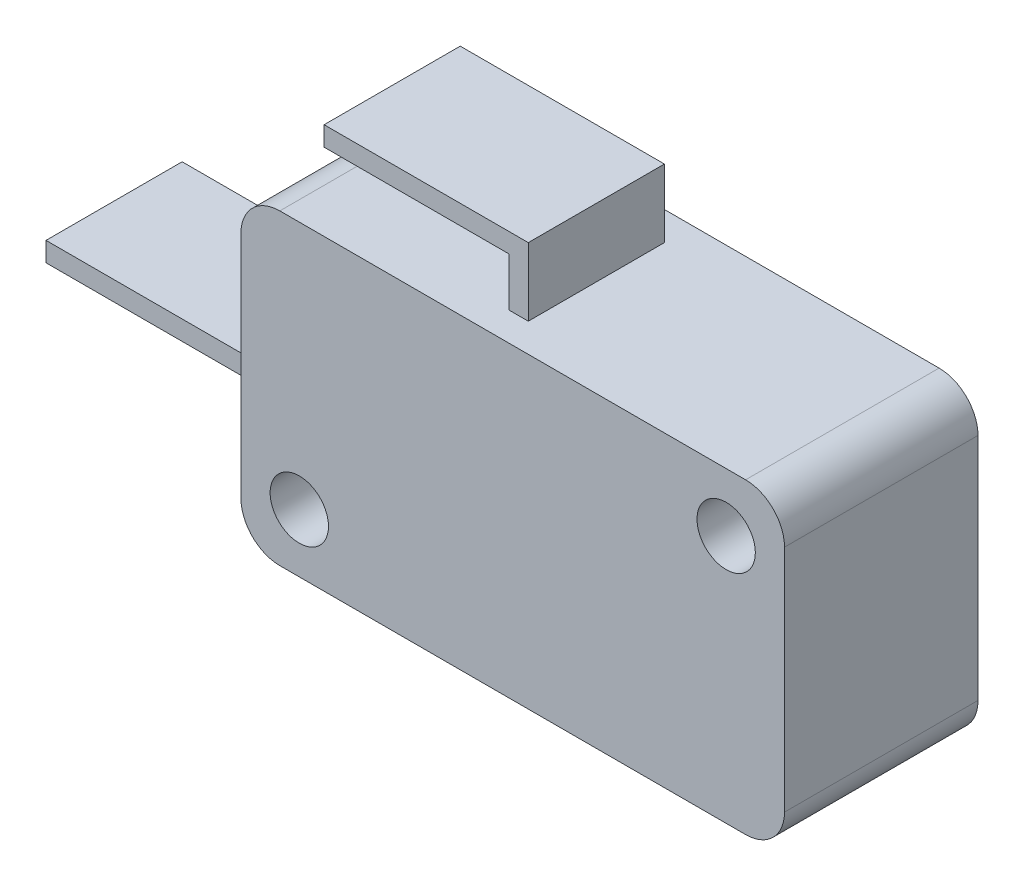
ISO-10303-21;
HEADER;
FILE_DESCRIPTION(('STEP AP214'),'2;1');
FILE_NAME('part.step','',(''),(''),'','','');
FILE_SCHEMA(('AUTOMOTIVE_DESIGN { 1 0 10303 214 1 1 1 1 }'));
ENDSEC;
DATA;
#1=APPLICATION_CONTEXT('core data for automotive mechanical design processes');
#2=APPLICATION_PROTOCOL_DEFINITION('international standard','automotive_design',2000,#1);
#3=PRODUCT_CONTEXT('',#1,'mechanical');
#4=PRODUCT('Part','Part','',(#3));
#5=PRODUCT_RELATED_PRODUCT_CATEGORY('part','',(#4));
#6=PRODUCT_DEFINITION_FORMATION('','',#4);
#7=PRODUCT_DEFINITION_CONTEXT('part definition',#1,'design');
#8=PRODUCT_DEFINITION('design','',#6,#7);
#9=PRODUCT_DEFINITION_SHAPE('','',#8);
#10=(LENGTH_UNIT() NAMED_UNIT(*) SI_UNIT(.MILLI.,.METRE.));
#11=(NAMED_UNIT(*) PLANE_ANGLE_UNIT() SI_UNIT($,.RADIAN.));
#12=(NAMED_UNIT(*) SI_UNIT($,.STERADIAN.) SOLID_ANGLE_UNIT());
#13=UNCERTAINTY_MEASURE_WITH_UNIT(LENGTH_MEASURE(1.E-05),#10,'distance_accuracy_value','');
#14=(GEOMETRIC_REPRESENTATION_CONTEXT(3) GLOBAL_UNCERTAINTY_ASSIGNED_CONTEXT((#13)) GLOBAL_UNIT_ASSIGNED_CONTEXT((#10,
#11,#12)) REPRESENTATION_CONTEXT('',''));
#15=CARTESIAN_POINT('',(0.,0.,0.));
#16=DIRECTION('',(0.,0.,1.));
#17=DIRECTION('',(1.,0.,0.));
#18=AXIS2_PLACEMENT_3D('',#15,#16,#17);
#19=CARTESIAN_POINT('',(-1.675,11.4,1.475));
#20=DIRECTION('',(1.,0.,0.));
#21=DIRECTION('',(0.,0.,-1.));
#22=AXIS2_PLACEMENT_3D('',#19,#20,#21);
#23=PLANE('',#22);
#24=DIRECTION('',(0.,0.,1.));
#25=VECTOR('',#24,1.);
#26=CARTESIAN_POINT('',(-1.675,10.4,1.475));
#27=LINE('',#26,#25);
#28=CARTESIAN_POINT('',(-1.675,10.4,1.475));
#29=VERTEX_POINT('',#28);
#30=CARTESIAN_POINT('',(-1.675,10.4,8.475));
#31=VERTEX_POINT('',#30);
#32=EDGE_CURVE('E270',#29,#31,#27,.T.);
#33=ORIENTED_EDGE('',*,*,#32,.F.);
#34=DIRECTION('',(0.,-1.,0.));
#35=VECTOR('',#34,1.);
#36=CARTESIAN_POINT('',(-1.675,11.4,1.475));
#37=LINE('',#36,#35);
#38=CARTESIAN_POINT('',(-1.675,7.9,1.475));
#39=VERTEX_POINT('',#38);
#40=EDGE_CURVE('E301',#29,#39,#37,.T.);
#41=ORIENTED_EDGE('',*,*,#40,.T.);
#42=DIRECTION('',(0.,0.,1.));
#43=VECTOR('',#42,1.);
#44=CARTESIAN_POINT('',(-1.675,7.9,1.475));
#45=LINE('',#44,#43);
#46=CARTESIAN_POINT('',(-1.675,7.9,8.475));
#47=VERTEX_POINT('',#46);
#48=EDGE_CURVE('E293',#39,#47,#45,.T.);
#49=ORIENTED_EDGE('',*,*,#48,.T.);
#50=DIRECTION('',(0.,-1.,0.));
#51=VECTOR('',#50,1.);
#52=CARTESIAN_POINT('',(-1.675,11.4,8.475));
#53=LINE('',#52,#51);
#54=EDGE_CURVE('E319',#31,#47,#53,.T.);
#55=ORIENTED_EDGE('',*,*,#54,.F.);
#56=EDGE_LOOP('',(#33,#41,#49,#55));
#57=FACE_BOUND('',#56,.T.);
#58=ADVANCED_FACE('F31',(#57),#23,.F.);
#59=CARTESIAN_POINT('',(-13.975,7.9,9.95));
#60=DIRECTION('',(0.,-1.,0.));
#61=DIRECTION('',(0.,0.,-1.));
#62=AXIS2_PLACEMENT_3D('',#59,#60,#61);
#63=PLANE('',#62);
#64=DIRECTION('',(-1.,0.,0.));
#65=VECTOR('',#64,1.);
#66=CARTESIAN_POINT('',(-13.975,7.9,0.));
#67=LINE('',#66,#65);
#68=CARTESIAN_POINT('',(11.975,7.9,0.));
#69=VERTEX_POINT('',#68);
#70=CARTESIAN_POINT('',(-11.975,7.9,0.));
#71=VERTEX_POINT('',#70);
#72=EDGE_CURVE('E371',#69,#71,#67,.T.);
#73=ORIENTED_EDGE('',*,*,#72,.T.);
#74=DIRECTION('',(0.,0.,-1.));
#75=VECTOR('',#74,1.);
#76=CARTESIAN_POINT('',(-11.975,7.9,9.95));
#77=LINE('',#76,#75);
#78=CARTESIAN_POINT('',(-11.975,7.9,9.95));
#79=VERTEX_POINT('',#78);
#80=EDGE_CURVE('E11',#71,#79,#77,.F.);
#81=ORIENTED_EDGE('',*,*,#80,.T.);
#82=DIRECTION('',(-1.,0.,0.));
#83=VECTOR('',#82,1.);
#84=CARTESIAN_POINT('',(-13.975,7.9,9.95));
#85=LINE('',#84,#83);
#86=CARTESIAN_POINT('',(11.975,7.9,9.95));
#87=VERTEX_POINT('',#86);
#88=EDGE_CURVE('E377',#87,#79,#85,.T.);
#89=ORIENTED_EDGE('',*,*,#88,.F.);
#90=DIRECTION('',(0.,0.,-1.));
#91=VECTOR('',#90,1.);
#92=CARTESIAN_POINT('',(11.975,7.9,9.95));
#93=LINE('',#92,#91);
#94=EDGE_CURVE('E39',#87,#69,#93,.T.);
#95=ORIENTED_EDGE('',*,*,#94,.T.);
#96=EDGE_LOOP('',(#73,#81,#89,#95));
#97=FACE_BOUND('',#96,.T.);
#98=ORIENTED_EDGE('',*,*,#48,.F.);
#99=DIRECTION('',(-1.,0.,0.));
#100=VECTOR('',#99,1.);
#101=CARTESIAN_POINT('',(-1.675,7.9,1.475));
#102=LINE('',#101,#100);
#103=CARTESIAN_POINT('',(-0.674999999999998,7.9,1.475));
#104=VERTEX_POINT('',#103);
#105=EDGE_CURVE('E297',#104,#39,#102,.T.);
#106=ORIENTED_EDGE('',*,*,#105,.F.);
#107=DIRECTION('',(0.,0.,-1.));
#108=VECTOR('',#107,1.);
#109=CARTESIAN_POINT('',(-0.674999999999998,7.9,1.475));
#110=LINE('',#109,#108);
#111=CARTESIAN_POINT('',(-0.674999999999997,7.9,8.475));
#112=VERTEX_POINT('',#111);
#113=EDGE_CURVE('E307',#112,#104,#110,.T.);
#114=ORIENTED_EDGE('',*,*,#113,.F.);
#115=DIRECTION('',(1.,0.,0.));
#116=VECTOR('',#115,1.);
#117=CARTESIAN_POINT('',(-1.675,7.9,8.475));
#118=LINE('',#117,#116);
#119=EDGE_CURVE('E304',#47,#112,#118,.T.);
#120=ORIENTED_EDGE('',*,*,#119,.F.);
#121=EDGE_LOOP('',(#98,#106,#114,#120));
#122=FACE_BOUND('',#121,.T.);
#123=ADVANCED_FACE('F425',(#97,#122),#63,.F.);
#124=CARTESIAN_POINT('',(-13.975,7.9,9.95));
#125=DIRECTION('',(1.,0.,0.));
#126=DIRECTION('',(0.,0.,-1.));
#127=AXIS2_PLACEMENT_3D('',#124,#125,#126);
#128=PLANE('',#127);
#129=DIRECTION('',(0.,-1.,0.));
#130=VECTOR('',#129,1.);
#131=CARTESIAN_POINT('',(-13.975,7.9,0.));
#132=LINE('',#131,#130);
#133=CARTESIAN_POINT('',(-13.975,5.9,0.));
#134=VERTEX_POINT('',#133);
#135=CARTESIAN_POINT('',(-13.975,-5.9,0.));
#136=VERTEX_POINT('',#135);
#137=EDGE_CURVE('E364',#134,#136,#132,.T.);
#138=ORIENTED_EDGE('',*,*,#137,.T.);
#139=DIRECTION('',(0.,0.,-1.));
#140=VECTOR('',#139,1.);
#141=CARTESIAN_POINT('',(-13.975,-5.9,9.95));
#142=LINE('',#141,#140);
#143=CARTESIAN_POINT('',(-13.975,-5.9,9.95));
#144=VERTEX_POINT('',#143);
#145=EDGE_CURVE('E406',#136,#144,#142,.F.);
#146=ORIENTED_EDGE('',*,*,#145,.T.);
#147=DIRECTION('',(0.,-1.,0.));
#148=VECTOR('',#147,1.);
#149=CARTESIAN_POINT('',(-13.975,7.9,9.95));
#150=LINE('',#149,#148);
#151=CARTESIAN_POINT('',(-13.975,5.9,9.95));
#152=VERTEX_POINT('',#151);
#153=EDGE_CURVE('E367',#152,#144,#150,.T.);
#154=ORIENTED_EDGE('',*,*,#153,.F.);
#155=DIRECTION('',(0.,0.,-1.));
#156=VECTOR('',#155,1.);
#157=CARTESIAN_POINT('',(-13.975,5.9,9.95));
#158=LINE('',#157,#156);
#159=EDGE_CURVE('E403',#152,#134,#158,.T.);
#160=ORIENTED_EDGE('',*,*,#159,.T.);
#161=EDGE_LOOP('',(#138,#146,#154,#160));
#162=FACE_BOUND('',#161,.T.);
#163=DIRECTION('',(0.,-1.,0.));
#164=VECTOR('',#163,1.);
#165=CARTESIAN_POINT('',(-13.975,-0.900000000000001,1.475));
#166=LINE('',#165,#164);
#167=CARTESIAN_POINT('',(-13.975,-0.900000000000001,1.475));
#168=VERTEX_POINT('',#167);
#169=CARTESIAN_POINT('',(-13.975,-1.9,1.475));
#170=VERTEX_POINT('',#169);
#171=EDGE_CURVE('E321',#168,#170,#166,.T.);
#172=ORIENTED_EDGE('',*,*,#171,.F.);
#173=DIRECTION('',(0.,0.,-1.));
#174=VECTOR('',#173,1.);
#175=CARTESIAN_POINT('',(-13.975,-0.900000000000001,1.475));
#176=LINE('',#175,#174);
#177=CARTESIAN_POINT('',(-13.975,-0.9,8.475));
#178=VERTEX_POINT('',#177);
#179=EDGE_CURVE('E326',#178,#168,#176,.T.);
#180=ORIENTED_EDGE('',*,*,#179,.F.);
#181=DIRECTION('',(0.,1.,0.));
#182=VECTOR('',#181,1.);
#183=CARTESIAN_POINT('',(-13.975,-0.9,8.475));
#184=LINE('',#183,#182);
#185=CARTESIAN_POINT('',(-13.975,-1.9,8.475));
#186=VERTEX_POINT('',#185);
#187=EDGE_CURVE('E338',#186,#178,#184,.T.);
#188=ORIENTED_EDGE('',*,*,#187,.F.);
#189=DIRECTION('',(0.,0.,1.));
#190=VECTOR('',#189,1.);
#191=CARTESIAN_POINT('',(-13.975,-1.9,1.475));
#192=LINE('',#191,#190);
#193=EDGE_CURVE('E335',#170,#186,#192,.T.);
#194=ORIENTED_EDGE('',*,*,#193,.F.);
#195=EDGE_LOOP('',(#172,#180,#188,#194));
#196=FACE_BOUND('',#195,.T.);
#197=ADVANCED_FACE('F441',(#162,#196),#128,.F.);
#198=CARTESIAN_POINT('',(-13.975,-7.9,9.95));
#199=DIRECTION('',(0.,1.,0.));
#200=DIRECTION('',(0.,0.,1.));
#201=AXIS2_PLACEMENT_3D('',#198,#199,#200);
#202=PLANE('',#201);
#203=DIRECTION('',(-1.,0.,0.));
#204=VECTOR('',#203,1.);
#205=CARTESIAN_POINT('',(-1.525,-7.9,7.33225893094414));
#206=LINE('',#205,#204);
#207=CARTESIAN_POINT('',(-1.525,-7.9,7.33225893094414));
#208=VERTEX_POINT('',#207);
#209=CARTESIAN_POINT('',(-2.525,-7.9,7.33225893094414));
#210=VERTEX_POINT('',#209);
#211=EDGE_CURVE('E235',#208,#210,#206,.T.);
#212=ORIENTED_EDGE('',*,*,#211,.F.);
#213=DIRECTION('',(0.,0.,1.));
#214=VECTOR('',#213,1.);
#215=CARTESIAN_POINT('',(-1.525,-7.9,7.33225893094414));
#216=LINE('',#215,#214);
#217=CARTESIAN_POINT('',(-1.525,-7.9,3.49599846688875));
#218=VERTEX_POINT('',#217);
#219=EDGE_CURVE('E46',#218,#208,#216,.T.);
#220=ORIENTED_EDGE('',*,*,#219,.F.);
#221=DIRECTION('',(1.,0.,0.));
#222=VECTOR('',#221,1.);
#223=CARTESIAN_POINT('',(-1.525,-7.9,3.49599846688875));
#224=LINE('',#223,#222);
#225=CARTESIAN_POINT('',(-2.525,-7.9,3.49599846688875));
#226=VERTEX_POINT('',#225);
#227=EDGE_CURVE('E223',#226,#218,#224,.T.);
#228=ORIENTED_EDGE('',*,*,#227,.F.);
#229=DIRECTION('',(0.,0.,-1.));
#230=VECTOR('',#229,1.);
#231=CARTESIAN_POINT('',(-2.525,-7.9,7.33225893094414));
#232=LINE('',#231,#230);
#233=EDGE_CURVE('E226',#210,#226,#232,.T.);
#234=ORIENTED_EDGE('',*,*,#233,.F.);
#235=EDGE_LOOP('',(#212,#220,#228,#234));
#236=FACE_BOUND('',#235,.T.);
#237=DIRECTION('',(-1.,0.,0.));
#238=VECTOR('',#237,1.);
#239=CARTESIAN_POINT('',(9.575,-7.9,6.975));
#240=LINE('',#239,#238);
#241=CARTESIAN_POINT('',(9.575,-7.9,6.975));
#242=VERTEX_POINT('',#241);
#243=CARTESIAN_POINT('',(6.975,-7.9,6.975));
#244=VERTEX_POINT('',#243);
#245=EDGE_CURVE('E260',#242,#244,#240,.T.);
#246=ORIENTED_EDGE('',*,*,#245,.F.);
#247=DIRECTION('',(0.,0.,1.));
#248=VECTOR('',#247,1.);
#249=CARTESIAN_POINT('',(9.575,-7.9,6.975));
#250=LINE('',#249,#248);
#251=CARTESIAN_POINT('',(9.575,-7.9,2.975));
#252=VERTEX_POINT('',#251);
#253=EDGE_CURVE('E54',#252,#242,#250,.T.);
#254=ORIENTED_EDGE('',*,*,#253,.F.);
#255=DIRECTION('',(1.,0.,0.));
#256=VECTOR('',#255,1.);
#257=CARTESIAN_POINT('',(9.575,-7.9,2.975));
#258=LINE('',#257,#256);
#259=CARTESIAN_POINT('',(6.975,-7.9,2.975));
#260=VERTEX_POINT('',#259);
#261=EDGE_CURVE('E249',#260,#252,#258,.T.);
#262=ORIENTED_EDGE('',*,*,#261,.F.);
#263=DIRECTION('',(0.,0.,-1.));
#264=VECTOR('',#263,1.);
#265=CARTESIAN_POINT('',(6.975,-7.9,6.975));
#266=LINE('',#265,#264);
#267=EDGE_CURVE('E263',#244,#260,#266,.T.);
#268=ORIENTED_EDGE('',*,*,#267,.F.);
#269=EDGE_LOOP('',(#246,#254,#262,#268));
#270=FACE_BOUND('',#269,.T.);
#271=DIRECTION('',(1.,0.,0.));
#272=VECTOR('',#271,1.);
#273=CARTESIAN_POINT('',(-13.975,-7.9,9.95));
#274=LINE('',#273,#272);
#275=CARTESIAN_POINT('',(-11.975,-7.9,9.95));
#276=VERTEX_POINT('',#275);
#277=CARTESIAN_POINT('',(11.975,-7.9,9.95));
#278=VERTEX_POINT('',#277);
#279=EDGE_CURVE('E370',#276,#278,#274,.T.);
#280=ORIENTED_EDGE('',*,*,#279,.F.);
#281=DIRECTION('',(0.,0.,-1.));
#282=VECTOR('',#281,1.);
#283=CARTESIAN_POINT('',(-11.975,-7.9,9.95));
#284=LINE('',#283,#282);
#285=CARTESIAN_POINT('',(-11.975,-7.9,0.));
#286=VERTEX_POINT('',#285);
#287=EDGE_CURVE('E392',#276,#286,#284,.T.);
#288=ORIENTED_EDGE('',*,*,#287,.T.);
#289=DIRECTION('',(1.,0.,0.));
#290=VECTOR('',#289,1.);
#291=CARTESIAN_POINT('',(-13.975,-7.9,0.));
#292=LINE('',#291,#290);
#293=CARTESIAN_POINT('',(11.975,-7.9,0.));
#294=VERTEX_POINT('',#293);
#295=EDGE_CURVE('E383',#286,#294,#292,.T.);
#296=ORIENTED_EDGE('',*,*,#295,.T.);
#297=DIRECTION('',(0.,0.,-1.));
#298=VECTOR('',#297,1.);
#299=CARTESIAN_POINT('',(11.975,-7.9,9.95));
#300=LINE('',#299,#298);
#301=EDGE_CURVE('E380',#294,#278,#300,.F.);
#302=ORIENTED_EDGE('',*,*,#301,.T.);
#303=EDGE_LOOP('',(#280,#288,#296,#302));
#304=FACE_BOUND('',#303,.T.);
#305=ADVANCED_FACE('F452',(#236,#270,#304),#202,.F.);
#306=CARTESIAN_POINT('',(13.975,7.9,9.95));
#307=DIRECTION('',(-1.,0.,0.));
#308=DIRECTION('',(0.,-1.,0.));
#309=AXIS2_PLACEMENT_3D('',#306,#307,#308);
#310=PLANE('',#309);
#311=DIRECTION('',(0.,1.,0.));
#312=VECTOR('',#311,1.);
#313=CARTESIAN_POINT('',(13.975,7.9,9.95));
#314=LINE('',#313,#312);
#315=CARTESIAN_POINT('',(13.975,-5.9,9.95));
#316=VERTEX_POINT('',#315);
#317=CARTESIAN_POINT('',(13.975,5.9,9.95));
#318=VERTEX_POINT('',#317);
#319=EDGE_CURVE('E374',#316,#318,#314,.T.);
#320=ORIENTED_EDGE('',*,*,#319,.F.);
#321=DIRECTION('',(0.,0.,-1.));
#322=VECTOR('',#321,1.);
#323=CARTESIAN_POINT('',(13.975,-5.9,9.95));
#324=LINE('',#323,#322);
#325=CARTESIAN_POINT('',(13.975,-5.9,0.));
#326=VERTEX_POINT('',#325);
#327=EDGE_CURVE('E418',#316,#326,#324,.T.);
#328=ORIENTED_EDGE('',*,*,#327,.T.);
#329=DIRECTION('',(0.,1.,0.));
#330=VECTOR('',#329,1.);
#331=CARTESIAN_POINT('',(13.975,7.9,0.));
#332=LINE('',#331,#330);
#333=CARTESIAN_POINT('',(13.975,5.9,0.));
#334=VERTEX_POINT('',#333);
#335=EDGE_CURVE('E386',#326,#334,#332,.T.);
#336=ORIENTED_EDGE('',*,*,#335,.T.);
#337=DIRECTION('',(0.,0.,-1.));
#338=VECTOR('',#337,1.);
#339=CARTESIAN_POINT('',(13.975,5.9,9.95));
#340=LINE('',#339,#338);
#341=EDGE_CURVE('E416',#334,#318,#340,.F.);
#342=ORIENTED_EDGE('',*,*,#341,.T.);
#343=EDGE_LOOP('',(#320,#328,#336,#342));
#344=FACE_BOUND('',#343,.T.);
#345=ADVANCED_FACE('F460',(#344),#310,.F.);
#346=CARTESIAN_POINT('',(-13.975,-7.9,9.95));
#347=DIRECTION('',(0.,0.,1.));
#348=DIRECTION('',(1.,0.,0.));
#349=AXIS2_PLACEMENT_3D('',#346,#347,#348);
#350=PLANE('',#349);
#351=CARTESIAN_POINT('',(-10.975,-4.9,9.95));
#352=DIRECTION('',(0.,0.,1.));
#353=DIRECTION('',(1.,0.,0.));
#354=AXIS2_PLACEMENT_3D('',#351,#352,#353);
#355=CIRCLE('',#354,1.5);
#356=CARTESIAN_POINT('',(-9.475,-4.9,9.95));
#357=VERTEX_POINT('',#356);
#358=EDGE_CURVE('E354',#357,#357,#355,.T.);
#359=ORIENTED_EDGE('',*,*,#358,.F.);
#360=EDGE_LOOP('',(#359));
#361=FACE_BOUND('',#360,.T.);
#362=CARTESIAN_POINT('',(10.975,4.9,9.95));
#363=DIRECTION('',(0.,0.,1.));
#364=DIRECTION('',(1.,0.,0.));
#365=AXIS2_PLACEMENT_3D('',#362,#363,#364);
#366=CIRCLE('',#365,1.5);
#367=CARTESIAN_POINT('',(12.475,4.9,9.95));
#368=VERTEX_POINT('',#367);
#369=EDGE_CURVE('E358',#368,#368,#366,.T.);
#370=ORIENTED_EDGE('',*,*,#369,.F.);
#371=EDGE_LOOP('',(#370));
#372=FACE_BOUND('',#371,.T.);
#373=ORIENTED_EDGE('',*,*,#153,.T.);
#374=CARTESIAN_POINT('',(-11.975,-5.9,9.95));
#375=DIRECTION('',(0.,0.,1.));
#376=DIRECTION('',(1.,0.,0.));
#377=AXIS2_PLACEMENT_3D('',#374,#375,#376);
#378=CIRCLE('',#377,2.);
#379=EDGE_CURVE('E414',#144,#276,#378,.T.);
#380=ORIENTED_EDGE('',*,*,#379,.T.);
#381=ORIENTED_EDGE('',*,*,#279,.T.);
#382=CARTESIAN_POINT('',(11.975,-5.9,9.95));
#383=DIRECTION('',(0.,0.,1.));
#384=DIRECTION('',(1.,0.,0.));
#385=AXIS2_PLACEMENT_3D('',#382,#383,#384);
#386=CIRCLE('',#385,2.);
#387=EDGE_CURVE('E412',#278,#316,#386,.T.);
#388=ORIENTED_EDGE('',*,*,#387,.T.);
#389=ORIENTED_EDGE('',*,*,#319,.T.);
#390=CARTESIAN_POINT('',(11.975,5.9,9.95));
#391=DIRECTION('',(0.,0.,1.));
#392=DIRECTION('',(1.,0.,0.));
#393=AXIS2_PLACEMENT_3D('',#390,#391,#392);
#394=CIRCLE('',#393,2.);
#395=EDGE_CURVE('E408',#318,#87,#394,.T.);
#396=ORIENTED_EDGE('',*,*,#395,.T.);
#397=ORIENTED_EDGE('',*,*,#88,.T.);
#398=CARTESIAN_POINT('',(-11.975,5.9,9.95));
#399=DIRECTION('',(0.,0.,1.));
#400=DIRECTION('',(1.,0.,0.));
#401=AXIS2_PLACEMENT_3D('',#398,#399,#400);
#402=CIRCLE('',#401,2.);
#403=EDGE_CURVE('E410',#79,#152,#402,.T.);
#404=ORIENTED_EDGE('',*,*,#403,.T.);
#405=EDGE_LOOP('',(#373,#380,#381,#388,#389,#396,#397,#404));
#406=FACE_BOUND('',#405,.T.);
#407=ADVANCED_FACE('F446',(#361,#372,#406),#350,.T.);
#408=CARTESIAN_POINT('',(-13.975,-7.9,0.));
#409=DIRECTION('',(0.,0.,1.));
#410=DIRECTION('',(1.,0.,0.));
#411=AXIS2_PLACEMENT_3D('',#408,#409,#410);
#412=PLANE('',#411);
#413=CARTESIAN_POINT('',(-10.975,-4.9,0.));
#414=DIRECTION('',(0.,0.,1.));
#415=DIRECTION('',(1.,0.,0.));
#416=AXIS2_PLACEMENT_3D('',#413,#414,#415);
#417=CIRCLE('',#416,1.5);
#418=CARTESIAN_POINT('',(-9.475,-4.9,0.));
#419=VERTEX_POINT('',#418);
#420=EDGE_CURVE('E355',#419,#419,#417,.T.);
#421=ORIENTED_EDGE('',*,*,#420,.T.);
#422=EDGE_LOOP('',(#421));
#423=FACE_BOUND('',#422,.T.);
#424=CARTESIAN_POINT('',(10.975,4.9,0.));
#425=DIRECTION('',(0.,0.,1.));
#426=DIRECTION('',(1.,0.,0.));
#427=AXIS2_PLACEMENT_3D('',#424,#425,#426);
#428=CIRCLE('',#427,1.5);
#429=CARTESIAN_POINT('',(12.475,4.9,0.));
#430=VERTEX_POINT('',#429);
#431=EDGE_CURVE('E361',#430,#430,#428,.T.);
#432=ORIENTED_EDGE('',*,*,#431,.T.);
#433=EDGE_LOOP('',(#432));
#434=FACE_BOUND('',#433,.T.);
#435=ORIENTED_EDGE('',*,*,#295,.F.);
#436=CARTESIAN_POINT('',(-11.975,-5.9,0.));
#437=DIRECTION('',(0.,0.,1.));
#438=DIRECTION('',(1.,0.,0.));
#439=AXIS2_PLACEMENT_3D('',#436,#437,#438);
#440=CIRCLE('',#439,2.);
#441=EDGE_CURVE('E401',#286,#136,#440,.F.);
#442=ORIENTED_EDGE('',*,*,#441,.T.);
#443=ORIENTED_EDGE('',*,*,#137,.F.);
#444=CARTESIAN_POINT('',(-11.975,5.9,0.));
#445=DIRECTION('',(0.,0.,1.));
#446=DIRECTION('',(1.,0.,0.));
#447=AXIS2_PLACEMENT_3D('',#444,#445,#446);
#448=CIRCLE('',#447,2.);
#449=EDGE_CURVE('E397',#134,#71,#448,.F.);
#450=ORIENTED_EDGE('',*,*,#449,.T.);
#451=ORIENTED_EDGE('',*,*,#72,.F.);
#452=CARTESIAN_POINT('',(11.975,5.9,0.));
#453=DIRECTION('',(0.,0.,1.));
#454=DIRECTION('',(1.,0.,0.));
#455=AXIS2_PLACEMENT_3D('',#452,#453,#454);
#456=CIRCLE('',#455,2.);
#457=EDGE_CURVE('E395',#69,#334,#456,.F.);
#458=ORIENTED_EDGE('',*,*,#457,.T.);
#459=ORIENTED_EDGE('',*,*,#335,.F.);
#460=CARTESIAN_POINT('',(11.975,-5.9,0.));
#461=DIRECTION('',(0.,0.,1.));
#462=DIRECTION('',(1.,0.,0.));
#463=AXIS2_PLACEMENT_3D('',#460,#461,#462);
#464=CIRCLE('',#463,2.);
#465=EDGE_CURVE('E399',#326,#294,#464,.F.);
#466=ORIENTED_EDGE('',*,*,#465,.T.);
#467=EDGE_LOOP('',(#435,#442,#443,#450,#451,#458,#459,#466));
#468=FACE_BOUND('',#467,.T.);
#469=ADVANCED_FACE('F432',(#423,#434,#468),#412,.F.);
#470=CARTESIAN_POINT('',(10.975,4.9,0.));
#471=DIRECTION('',(0.,0.,1.));
#472=DIRECTION('',(1.,0.,0.));
#473=AXIS2_PLACEMENT_3D('',#470,#471,#472);
#474=CYLINDRICAL_SURFACE('',#473,1.5);
#475=ORIENTED_EDGE('',*,*,#431,.F.);
#476=EDGE_LOOP('',(#475));
#477=FACE_BOUND('',#476,.T.);
#478=ORIENTED_EDGE('',*,*,#369,.T.);
#479=EDGE_LOOP('',(#478));
#480=FACE_BOUND('',#479,.T.);
#481=ADVANCED_FACE('F501',(#477,#480),#474,.F.);
#482=CARTESIAN_POINT('',(-10.975,-4.9,0.));
#483=DIRECTION('',(0.,0.,1.));
#484=DIRECTION('',(1.,0.,0.));
#485=AXIS2_PLACEMENT_3D('',#482,#483,#484);
#486=CYLINDRICAL_SURFACE('',#485,1.5);
#487=ORIENTED_EDGE('',*,*,#420,.F.);
#488=EDGE_LOOP('',(#487));
#489=FACE_BOUND('',#488,.T.);
#490=ORIENTED_EDGE('',*,*,#358,.T.);
#491=EDGE_LOOP('',(#490));
#492=FACE_BOUND('',#491,.T.);
#493=ADVANCED_FACE('F498',(#489,#492),#486,.F.);
#494=CARTESIAN_POINT('',(-11.975,-5.9,9.95));
#495=DIRECTION('',(0.,0.,-1.));
#496=DIRECTION('',(-1.,0.,0.));
#497=AXIS2_PLACEMENT_3D('',#494,#495,#496);
#498=CYLINDRICAL_SURFACE('',#497,2.);
#499=ORIENTED_EDGE('',*,*,#379,.F.);
#500=ORIENTED_EDGE('',*,*,#145,.F.);
#501=ORIENTED_EDGE('',*,*,#441,.F.);
#502=ORIENTED_EDGE('',*,*,#287,.F.);
#503=EDGE_LOOP('',(#499,#500,#501,#502));
#504=FACE_BOUND('',#503,.T.);
#505=ADVANCED_FACE('F450',(#504),#498,.T.);
#506=CARTESIAN_POINT('',(11.975,-5.9,9.95));
#507=DIRECTION('',(0.,0.,-1.));
#508=DIRECTION('',(-1.,0.,0.));
#509=AXIS2_PLACEMENT_3D('',#506,#507,#508);
#510=CYLINDRICAL_SURFACE('',#509,2.);
#511=ORIENTED_EDGE('',*,*,#387,.F.);
#512=ORIENTED_EDGE('',*,*,#301,.F.);
#513=ORIENTED_EDGE('',*,*,#465,.F.);
#514=ORIENTED_EDGE('',*,*,#327,.F.);
#515=EDGE_LOOP('',(#511,#512,#513,#514));
#516=FACE_BOUND('',#515,.T.);
#517=ADVANCED_FACE('F457',(#516),#510,.T.);
#518=CARTESIAN_POINT('',(-11.975,5.9,9.95));
#519=DIRECTION('',(0.,0.,-1.));
#520=DIRECTION('',(-1.,0.,0.));
#521=AXIS2_PLACEMENT_3D('',#518,#519,#520);
#522=CYLINDRICAL_SURFACE('',#521,2.);
#523=ORIENTED_EDGE('',*,*,#403,.F.);
#524=ORIENTED_EDGE('',*,*,#80,.F.);
#525=ORIENTED_EDGE('',*,*,#449,.F.);
#526=ORIENTED_EDGE('',*,*,#159,.F.);
#527=EDGE_LOOP('',(#523,#524,#525,#526));
#528=FACE_BOUND('',#527,.T.);
#529=ADVANCED_FACE('F438',(#528),#522,.T.);
#530=CARTESIAN_POINT('',(11.975,5.9,9.95));
#531=DIRECTION('',(0.,0.,-1.));
#532=DIRECTION('',(-1.,0.,0.));
#533=AXIS2_PLACEMENT_3D('',#530,#531,#532);
#534=CYLINDRICAL_SURFACE('',#533,2.);
#535=ORIENTED_EDGE('',*,*,#395,.F.);
#536=ORIENTED_EDGE('',*,*,#341,.F.);
#537=ORIENTED_EDGE('',*,*,#457,.F.);
#538=ORIENTED_EDGE('',*,*,#94,.F.);
#539=EDGE_LOOP('',(#535,#536,#537,#538));
#540=FACE_BOUND('',#539,.T.);
#541=ADVANCED_FACE('F33',(#540),#534,.T.);
#542=CARTESIAN_POINT('',(-25.475,-0.900000000000001,1.475));
#543=DIRECTION('',(0.,0.,1.));
#544=DIRECTION('',(1.,0.,0.));
#545=AXIS2_PLACEMENT_3D('',#542,#543,#544);
#546=PLANE('',#545);
#547=ORIENTED_EDGE('',*,*,#171,.T.);
#548=DIRECTION('',(1.,0.,0.));
#549=VECTOR('',#548,1.);
#550=CARTESIAN_POINT('',(-25.475,-1.9,1.475));
#551=LINE('',#550,#549);
#552=CARTESIAN_POINT('',(-25.475,-1.9,1.475));
#553=VERTEX_POINT('',#552);
#554=EDGE_CURVE('E351',#553,#170,#551,.T.);
#555=ORIENTED_EDGE('',*,*,#554,.F.);
#556=DIRECTION('',(0.,-1.,0.));
#557=VECTOR('',#556,1.);
#558=CARTESIAN_POINT('',(-25.475,-0.900000000000001,1.475));
#559=LINE('',#558,#557);
#560=CARTESIAN_POINT('',(-25.475,-0.900000000000001,1.475));
#561=VERTEX_POINT('',#560);
#562=EDGE_CURVE('E322',#561,#553,#559,.T.);
#563=ORIENTED_EDGE('',*,*,#562,.F.);
#564=DIRECTION('',(1.,0.,0.));
#565=VECTOR('',#564,1.);
#566=CARTESIAN_POINT('',(-25.475,-0.900000000000001,1.475));
#567=LINE('',#566,#565);
#568=EDGE_CURVE('E332',#561,#168,#567,.T.);
#569=ORIENTED_EDGE('',*,*,#568,.T.);
#570=EDGE_LOOP('',(#547,#555,#563,#569));
#571=FACE_BOUND('',#570,.T.);
#572=ADVANCED_FACE('F463',(#571),#546,.F.);
#573=CARTESIAN_POINT('',(-25.475,-1.9,1.475));
#574=DIRECTION('',(0.,1.,0.));
#575=DIRECTION('',(0.,0.,1.));
#576=AXIS2_PLACEMENT_3D('',#573,#574,#575);
#577=PLANE('',#576);
#578=ORIENTED_EDGE('',*,*,#193,.T.);
#579=DIRECTION('',(1.,0.,0.));
#580=VECTOR('',#579,1.);
#581=CARTESIAN_POINT('',(-25.475,-1.9,8.475));
#582=LINE('',#581,#580);
#583=CARTESIAN_POINT('',(-25.475,-1.9,8.475));
#584=VERTEX_POINT('',#583);
#585=EDGE_CURVE('E348',#584,#186,#582,.T.);
#586=ORIENTED_EDGE('',*,*,#585,.F.);
#587=DIRECTION('',(0.,0.,1.));
#588=VECTOR('',#587,1.);
#589=CARTESIAN_POINT('',(-25.475,-1.9,1.475));
#590=LINE('',#589,#588);
#591=EDGE_CURVE('E325',#553,#584,#590,.T.);
#592=ORIENTED_EDGE('',*,*,#591,.F.);
#593=ORIENTED_EDGE('',*,*,#554,.T.);
#594=EDGE_LOOP('',(#578,#586,#592,#593));
#595=FACE_BOUND('',#594,.T.);
#596=ADVANCED_FACE('F468',(#595),#577,.F.);
#597=CARTESIAN_POINT('',(-25.475,-0.9,8.475));
#598=DIRECTION('',(0.,0.,-1.));
#599=DIRECTION('',(-1.,0.,0.));
#600=AXIS2_PLACEMENT_3D('',#597,#598,#599);
#601=PLANE('',#600);
#602=ORIENTED_EDGE('',*,*,#187,.T.);
#603=DIRECTION('',(1.,0.,0.));
#604=VECTOR('',#603,1.);
#605=CARTESIAN_POINT('',(-25.475,-0.9,8.475));
#606=LINE('',#605,#604);
#607=CARTESIAN_POINT('',(-25.475,-0.9,8.475));
#608=VERTEX_POINT('',#607);
#609=EDGE_CURVE('E345',#608,#178,#606,.T.);
#610=ORIENTED_EDGE('',*,*,#609,.F.);
#611=DIRECTION('',(0.,1.,0.));
#612=VECTOR('',#611,1.);
#613=CARTESIAN_POINT('',(-25.475,-0.9,8.475));
#614=LINE('',#613,#612);
#615=EDGE_CURVE('E328',#584,#608,#614,.T.);
#616=ORIENTED_EDGE('',*,*,#615,.F.);
#617=ORIENTED_EDGE('',*,*,#585,.T.);
#618=EDGE_LOOP('',(#602,#610,#616,#617));
#619=FACE_BOUND('',#618,.T.);
#620=ADVANCED_FACE('F490',(#619),#601,.F.);
#621=CARTESIAN_POINT('',(-25.475,-0.900000000000001,1.475));
#622=DIRECTION('',(0.,-1.,0.));
#623=DIRECTION('',(0.,0.,-1.));
#624=AXIS2_PLACEMENT_3D('',#621,#622,#623);
#625=PLANE('',#624);
#626=ORIENTED_EDGE('',*,*,#179,.T.);
#627=ORIENTED_EDGE('',*,*,#568,.F.);
#628=DIRECTION('',(0.,0.,-1.));
#629=VECTOR('',#628,1.);
#630=CARTESIAN_POINT('',(-25.475,-0.900000000000001,1.475));
#631=LINE('',#630,#629);
#632=EDGE_CURVE('E330',#608,#561,#631,.T.);
#633=ORIENTED_EDGE('',*,*,#632,.F.);
#634=ORIENTED_EDGE('',*,*,#609,.T.);
#635=EDGE_LOOP('',(#626,#627,#633,#634));
#636=FACE_BOUND('',#635,.T.);
#637=ADVANCED_FACE('F486',(#636),#625,.F.);
#638=CARTESIAN_POINT('',(-25.475,-1.9,1.475));
#639=DIRECTION('',(-1.,0.,0.));
#640=DIRECTION('',(0.,0.,1.));
#641=AXIS2_PLACEMENT_3D('',#638,#639,#640);
#642=PLANE('',#641);
#643=ORIENTED_EDGE('',*,*,#562,.T.);
#644=ORIENTED_EDGE('',*,*,#591,.T.);
#645=ORIENTED_EDGE('',*,*,#615,.T.);
#646=ORIENTED_EDGE('',*,*,#632,.T.);
#647=EDGE_LOOP('',(#643,#644,#645,#646));
#648=FACE_BOUND('',#647,.T.);
#649=ADVANCED_FACE('F483',(#648),#642,.T.);
#650=CARTESIAN_POINT('',(-1.675,11.4,8.475));
#651=DIRECTION('',(0.,0.,-1.));
#652=DIRECTION('',(-1.,0.,0.));
#653=AXIS2_PLACEMENT_3D('',#650,#651,#652);
#654=PLANE('',#653);
#655=ORIENTED_EDGE('',*,*,#119,.T.);
#656=DIRECTION('',(0.,-1.,0.));
#657=VECTOR('',#656,1.);
#658=CARTESIAN_POINT('',(-0.674999999999998,11.4,8.475));
#659=LINE('',#658,#657);
#660=CARTESIAN_POINT('',(-0.674999999999998,11.4,8.475));
#661=VERTEX_POINT('',#660);
#662=EDGE_CURVE('E316',#661,#112,#659,.T.);
#663=ORIENTED_EDGE('',*,*,#662,.F.);
#664=DIRECTION('',(1.,0.,0.));
#665=VECTOR('',#664,1.);
#666=CARTESIAN_POINT('',(-1.675,11.4,8.475));
#667=LINE('',#666,#665);
#668=CARTESIAN_POINT('',(-11.175,11.4,8.475));
#669=VERTEX_POINT('',#668);
#670=EDGE_CURVE('E294',#669,#661,#667,.T.);
#671=ORIENTED_EDGE('',*,*,#670,.F.);
#672=DIRECTION('',(0.,1.,0.));
#673=VECTOR('',#672,1.);
#674=CARTESIAN_POINT('',(-11.175,11.4,8.475));
#675=LINE('',#674,#673);
#676=CARTESIAN_POINT('',(-11.175,10.4,8.475));
#677=VERTEX_POINT('',#676);
#678=EDGE_CURVE('E281',#677,#669,#675,.T.);
#679=ORIENTED_EDGE('',*,*,#678,.F.);
#680=DIRECTION('',(1.,0.,0.));
#681=VECTOR('',#680,1.);
#682=CARTESIAN_POINT('',(-11.175,10.4,8.475));
#683=LINE('',#682,#681);
#684=EDGE_CURVE('E287',#677,#31,#683,.T.);
#685=ORIENTED_EDGE('',*,*,#684,.T.);
#686=ORIENTED_EDGE('',*,*,#54,.T.);
#687=EDGE_LOOP('',(#655,#663,#671,#679,#685,#686));
#688=FACE_BOUND('',#687,.T.);
#689=ADVANCED_FACE('F481',(#688),#654,.F.);
#690=CARTESIAN_POINT('',(-0.674999999999998,11.4,1.475));
#691=DIRECTION('',(-1.,0.,0.));
#692=DIRECTION('',(0.,0.,1.));
#693=AXIS2_PLACEMENT_3D('',#690,#691,#692);
#694=PLANE('',#693);
#695=ORIENTED_EDGE('',*,*,#113,.T.);
#696=DIRECTION('',(0.,-1.,0.));
#697=VECTOR('',#696,1.);
#698=CARTESIAN_POINT('',(-0.674999999999998,11.4,1.475));
#699=LINE('',#698,#697);
#700=CARTESIAN_POINT('',(-0.674999999999998,11.4,1.475));
#701=VERTEX_POINT('',#700);
#702=EDGE_CURVE('E313',#701,#104,#699,.T.);
#703=ORIENTED_EDGE('',*,*,#702,.F.);
#704=DIRECTION('',(0.,0.,-1.));
#705=VECTOR('',#704,1.);
#706=CARTESIAN_POINT('',(-0.674999999999998,11.4,1.475));
#707=LINE('',#706,#705);
#708=EDGE_CURVE('E296',#661,#701,#707,.T.);
#709=ORIENTED_EDGE('',*,*,#708,.F.);
#710=ORIENTED_EDGE('',*,*,#662,.T.);
#711=EDGE_LOOP('',(#695,#703,#709,#710));
#712=FACE_BOUND('',#711,.T.);
#713=ADVANCED_FACE('F583',(#712),#694,.F.);
#714=CARTESIAN_POINT('',(-1.675,11.4,1.475));
#715=DIRECTION('',(0.,0.,1.));
#716=DIRECTION('',(1.,0.,0.));
#717=AXIS2_PLACEMENT_3D('',#714,#715,#716);
#718=PLANE('',#717);
#719=ORIENTED_EDGE('',*,*,#105,.T.);
#720=ORIENTED_EDGE('',*,*,#40,.F.);
#721=DIRECTION('',(1.,0.,0.));
#722=VECTOR('',#721,1.);
#723=CARTESIAN_POINT('',(-11.175,10.4,1.475));
#724=LINE('',#723,#722);
#725=CARTESIAN_POINT('',(-11.175,10.4,1.475));
#726=VERTEX_POINT('',#725);
#727=EDGE_CURVE('E291',#726,#29,#724,.T.);
#728=ORIENTED_EDGE('',*,*,#727,.F.);
#729=DIRECTION('',(0.,-1.,0.));
#730=VECTOR('',#729,1.);
#731=CARTESIAN_POINT('',(-11.175,11.4,1.475));
#732=LINE('',#731,#730);
#733=CARTESIAN_POINT('',(-11.175,11.4,1.475));
#734=VERTEX_POINT('',#733);
#735=EDGE_CURVE('E276',#734,#726,#732,.T.);
#736=ORIENTED_EDGE('',*,*,#735,.F.);
#737=DIRECTION('',(-1.,0.,0.));
#738=VECTOR('',#737,1.);
#739=CARTESIAN_POINT('',(-1.675,11.4,1.475));
#740=LINE('',#739,#738);
#741=EDGE_CURVE('E299',#701,#734,#740,.T.);
#742=ORIENTED_EDGE('',*,*,#741,.F.);
#743=ORIENTED_EDGE('',*,*,#702,.T.);
#744=EDGE_LOOP('',(#719,#720,#728,#736,#742,#743));
#745=FACE_BOUND('',#744,.T.);
#746=ADVANCED_FACE('F587',(#745),#718,.F.);
#747=CARTESIAN_POINT('',(-1.675,11.4,8.475));
#748=DIRECTION('',(0.,1.,0.));
#749=DIRECTION('',(0.,0.,1.));
#750=AXIS2_PLACEMENT_3D('',#747,#748,#749);
#751=PLANE('',#750);
#752=ORIENTED_EDGE('',*,*,#741,.T.);
#753=DIRECTION('',(0.,0.,-1.));
#754=VECTOR('',#753,1.);
#755=CARTESIAN_POINT('',(-11.175,11.4,1.475));
#756=LINE('',#755,#754);
#757=EDGE_CURVE('E284',#669,#734,#756,.T.);
#758=ORIENTED_EDGE('',*,*,#757,.F.);
#759=ORIENTED_EDGE('',*,*,#670,.T.);
#760=ORIENTED_EDGE('',*,*,#708,.T.);
#761=EDGE_LOOP('',(#752,#758,#759,#760));
#762=FACE_BOUND('',#761,.T.);
#763=ADVANCED_FACE('F610',(#762),#751,.T.);
#764=CARTESIAN_POINT('',(-11.175,10.4,1.475));
#765=DIRECTION('',(0.,1.,0.));
#766=DIRECTION('',(0.,0.,1.));
#767=AXIS2_PLACEMENT_3D('',#764,#765,#766);
#768=PLANE('',#767);
#769=ORIENTED_EDGE('',*,*,#32,.T.);
#770=ORIENTED_EDGE('',*,*,#684,.F.);
#771=DIRECTION('',(0.,0.,1.));
#772=VECTOR('',#771,1.);
#773=CARTESIAN_POINT('',(-11.175,10.4,1.475));
#774=LINE('',#773,#772);
#775=EDGE_CURVE('E279',#726,#677,#774,.T.);
#776=ORIENTED_EDGE('',*,*,#775,.F.);
#777=ORIENTED_EDGE('',*,*,#727,.T.);
#778=EDGE_LOOP('',(#769,#770,#776,#777));
#779=FACE_BOUND('',#778,.T.);
#780=ADVANCED_FACE('F620',(#779),#768,.F.);
#781=CARTESIAN_POINT('',(-11.175,10.4,1.475));
#782=DIRECTION('',(-1.,0.,0.));
#783=DIRECTION('',(0.,0.,1.));
#784=AXIS2_PLACEMENT_3D('',#781,#782,#783);
#785=PLANE('',#784);
#786=ORIENTED_EDGE('',*,*,#735,.T.);
#787=ORIENTED_EDGE('',*,*,#775,.T.);
#788=ORIENTED_EDGE('',*,*,#678,.T.);
#789=ORIENTED_EDGE('',*,*,#757,.T.);
#790=EDGE_LOOP('',(#786,#787,#788,#789));
#791=FACE_BOUND('',#790,.T.);
#792=ADVANCED_FACE('F630',(#791),#785,.T.);
#793=CARTESIAN_POINT('',(9.575,-4.9,6.975));
#794=DIRECTION('',(1.,0.,0.));
#795=DIRECTION('',(0.,0.,-1.));
#796=AXIS2_PLACEMENT_3D('',#793,#794,#795);
#797=PLANE('',#796);
#798=ORIENTED_EDGE('',*,*,#253,.T.);
#799=DIRECTION('',(0.,-1.,0.));
#800=VECTOR('',#799,1.);
#801=CARTESIAN_POINT('',(9.575,-4.9,6.975));
#802=LINE('',#801,#800);
#803=CARTESIAN_POINT('',(9.575,-4.9,6.975));
#804=VERTEX_POINT('',#803);
#805=EDGE_CURVE('E258',#804,#242,#802,.T.);
#806=ORIENTED_EDGE('',*,*,#805,.F.);
#807=DIRECTION('',(0.,0.,1.));
#808=VECTOR('',#807,1.);
#809=CARTESIAN_POINT('',(9.575,-4.9,6.975));
#810=LINE('',#809,#808);
#811=CARTESIAN_POINT('',(9.575,-4.9,2.975));
#812=VERTEX_POINT('',#811);
#813=EDGE_CURVE('E245',#812,#804,#810,.T.);
#814=ORIENTED_EDGE('',*,*,#813,.F.);
#815=DIRECTION('',(0.,-1.,0.));
#816=VECTOR('',#815,1.);
#817=CARTESIAN_POINT('',(9.575,-4.9,2.975));
#818=LINE('',#817,#816);
#819=EDGE_CURVE('E268',#812,#252,#818,.T.);
#820=ORIENTED_EDGE('',*,*,#819,.T.);
#821=EDGE_LOOP('',(#798,#806,#814,#820));
#822=FACE_BOUND('',#821,.T.);
#823=ADVANCED_FACE('F640',(#822),#797,.F.);
#824=CARTESIAN_POINT('',(9.575,-4.9,2.975));
#825=DIRECTION('',(0.,0.,-1.));
#826=DIRECTION('',(-1.,0.,0.));
#827=AXIS2_PLACEMENT_3D('',#824,#825,#826);
#828=PLANE('',#827);
#829=ORIENTED_EDGE('',*,*,#261,.T.);
#830=ORIENTED_EDGE('',*,*,#819,.F.);
#831=DIRECTION('',(1.,0.,0.));
#832=VECTOR('',#831,1.);
#833=CARTESIAN_POINT('',(9.575,-4.9,2.975));
#834=LINE('',#833,#832);
#835=CARTESIAN_POINT('',(6.975,-4.9,2.975));
#836=VERTEX_POINT('',#835);
#837=EDGE_CURVE('E255',#836,#812,#834,.T.);
#838=ORIENTED_EDGE('',*,*,#837,.F.);
#839=DIRECTION('',(0.,-1.,0.));
#840=VECTOR('',#839,1.);
#841=CARTESIAN_POINT('',(6.975,-4.9,2.975));
#842=LINE('',#841,#840);
#843=EDGE_CURVE('E271',#836,#260,#842,.T.);
#844=ORIENTED_EDGE('',*,*,#843,.T.);
#845=EDGE_LOOP('',(#829,#830,#838,#844));
#846=FACE_BOUND('',#845,.T.);
#847=ADVANCED_FACE('F650',(#846),#828,.F.);
#848=CARTESIAN_POINT('',(6.975,-4.9,6.975));
#849=DIRECTION('',(-1.,0.,0.));
#850=DIRECTION('',(0.,0.,1.));
#851=AXIS2_PLACEMENT_3D('',#848,#849,#850);
#852=PLANE('',#851);
#853=ORIENTED_EDGE('',*,*,#267,.T.);
#854=ORIENTED_EDGE('',*,*,#843,.F.);
#855=DIRECTION('',(0.,0.,-1.));
#856=VECTOR('',#855,1.);
#857=CARTESIAN_POINT('',(6.975,-4.9,6.975));
#858=LINE('',#857,#856);
#859=CARTESIAN_POINT('',(6.975,-4.9,6.975));
#860=VERTEX_POINT('',#859);
#861=EDGE_CURVE('E252',#860,#836,#858,.T.);
#862=ORIENTED_EDGE('',*,*,#861,.F.);
#863=DIRECTION('',(0.,-1.,0.));
#864=VECTOR('',#863,1.);
#865=CARTESIAN_POINT('',(6.975,-4.9,6.975));
#866=LINE('',#865,#864);
#867=EDGE_CURVE('E273',#860,#244,#866,.T.);
#868=ORIENTED_EDGE('',*,*,#867,.T.);
#869=EDGE_LOOP('',(#853,#854,#862,#868));
#870=FACE_BOUND('',#869,.T.);
#871=ADVANCED_FACE('F659',(#870),#852,.F.);
#872=CARTESIAN_POINT('',(9.575,-4.9,6.975));
#873=DIRECTION('',(0.,0.,1.));
#874=DIRECTION('',(1.,0.,0.));
#875=AXIS2_PLACEMENT_3D('',#872,#873,#874);
#876=PLANE('',#875);
#877=ORIENTED_EDGE('',*,*,#245,.T.);
#878=ORIENTED_EDGE('',*,*,#867,.F.);
#879=DIRECTION('',(-1.,0.,0.));
#880=VECTOR('',#879,1.);
#881=CARTESIAN_POINT('',(9.575,-4.9,6.975));
#882=LINE('',#881,#880);
#883=EDGE_CURVE('E248',#804,#860,#882,.T.);
#884=ORIENTED_EDGE('',*,*,#883,.F.);
#885=ORIENTED_EDGE('',*,*,#805,.T.);
#886=EDGE_LOOP('',(#877,#878,#884,#885));
#887=FACE_BOUND('',#886,.T.);
#888=ADVANCED_FACE('F669',(#887),#876,.F.);
#889=CARTESIAN_POINT('',(9.575,-4.9,2.975));
#890=DIRECTION('',(0.,1.,0.));
#891=DIRECTION('',(0.,0.,1.));
#892=AXIS2_PLACEMENT_3D('',#889,#890,#891);
#893=PLANE('',#892);
#894=ORIENTED_EDGE('',*,*,#813,.T.);
#895=ORIENTED_EDGE('',*,*,#883,.T.);
#896=ORIENTED_EDGE('',*,*,#861,.T.);
#897=ORIENTED_EDGE('',*,*,#837,.T.);
#898=EDGE_LOOP('',(#894,#895,#896,#897));
#899=FACE_BOUND('',#898,.T.);
#900=ADVANCED_FACE('F679',(#899),#893,.F.);
#901=CARTESIAN_POINT('',(-1.525,-4.9,7.33225893094414));
#902=DIRECTION('',(1.,0.,0.));
#903=DIRECTION('',(0.,0.,-1.));
#904=AXIS2_PLACEMENT_3D('',#901,#902,#903);
#905=PLANE('',#904);
#906=ORIENTED_EDGE('',*,*,#219,.T.);
#907=DIRECTION('',(0.,-1.,0.));
#908=VECTOR('',#907,1.);
#909=CARTESIAN_POINT('',(-1.525,-4.9,7.33225893094414));
#910=LINE('',#909,#908);
#911=CARTESIAN_POINT('',(-1.525,-4.9,7.33225893094414));
#912=VERTEX_POINT('',#911);
#913=EDGE_CURVE('E201',#912,#208,#910,.T.);
#914=ORIENTED_EDGE('',*,*,#913,.F.);
#915=DIRECTION('',(0.,0.,1.));
#916=VECTOR('',#915,1.);
#917=CARTESIAN_POINT('',(-1.525,-4.9,7.33225893094414));
#918=LINE('',#917,#916);
#919=CARTESIAN_POINT('',(-1.525,-4.9,3.49599846688875));
#920=VERTEX_POINT('',#919);
#921=EDGE_CURVE('E205',#920,#912,#918,.T.);
#922=ORIENTED_EDGE('',*,*,#921,.F.);
#923=DIRECTION('',(0.,-1.,0.));
#924=VECTOR('',#923,1.);
#925=CARTESIAN_POINT('',(-1.525,-4.9,3.49599846688875));
#926=LINE('',#925,#924);
#927=EDGE_CURVE('E240',#920,#218,#926,.T.);
#928=ORIENTED_EDGE('',*,*,#927,.T.);
#929=EDGE_LOOP('',(#906,#914,#922,#928));
#930=FACE_BOUND('',#929,.T.);
#931=ADVANCED_FACE('F203',(#930),#905,.F.);
#932=CARTESIAN_POINT('',(-1.525,-4.9,3.49599846688875));
#933=DIRECTION('',(0.,0.,-1.));
#934=DIRECTION('',(-1.,0.,0.));
#935=AXIS2_PLACEMENT_3D('',#932,#933,#934);
#936=PLANE('',#935);
#937=ORIENTED_EDGE('',*,*,#227,.T.);
#938=ORIENTED_EDGE('',*,*,#927,.F.);
#939=DIRECTION('',(1.,0.,0.));
#940=VECTOR('',#939,1.);
#941=CARTESIAN_POINT('',(-1.525,-4.9,3.49599846688875));
#942=LINE('',#941,#940);
#943=CARTESIAN_POINT('',(-2.525,-4.9,3.49599846688875));
#944=VERTEX_POINT('',#943);
#945=EDGE_CURVE('E211',#944,#920,#942,.T.);
#946=ORIENTED_EDGE('',*,*,#945,.F.);
#947=DIRECTION('',(0.,-1.,0.));
#948=VECTOR('',#947,1.);
#949=CARTESIAN_POINT('',(-2.525,-4.9,3.49599846688875));
#950=LINE('',#949,#948);
#951=EDGE_CURVE('E242',#944,#226,#950,.T.);
#952=ORIENTED_EDGE('',*,*,#951,.T.);
#953=EDGE_LOOP('',(#937,#938,#946,#952));
#954=FACE_BOUND('',#953,.T.);
#955=ADVANCED_FACE('F705',(#954),#936,.F.);
#956=CARTESIAN_POINT('',(-2.525,-4.9,7.33225893094414));
#957=DIRECTION('',(-1.,0.,0.));
#958=DIRECTION('',(0.,0.,1.));
#959=AXIS2_PLACEMENT_3D('',#956,#957,#958);
#960=PLANE('',#959);
#961=ORIENTED_EDGE('',*,*,#233,.T.);
#962=ORIENTED_EDGE('',*,*,#951,.F.);
#963=DIRECTION('',(0.,0.,-1.));
#964=VECTOR('',#963,1.);
#965=CARTESIAN_POINT('',(-2.525,-4.9,7.33225893094414));
#966=LINE('',#965,#964);
#967=CARTESIAN_POINT('',(-2.525,-4.9,7.33225893094414));
#968=VERTEX_POINT('',#967);
#969=EDGE_CURVE('E219',#968,#944,#966,.T.);
#970=ORIENTED_EDGE('',*,*,#969,.F.);
#971=DIRECTION('',(0.,-1.,0.));
#972=VECTOR('',#971,1.);
#973=CARTESIAN_POINT('',(-2.525,-4.9,7.33225893094414));
#974=LINE('',#973,#972);
#975=EDGE_CURVE('E210',#968,#210,#974,.T.);
#976=ORIENTED_EDGE('',*,*,#975,.T.);
#977=EDGE_LOOP('',(#961,#962,#970,#976));
#978=FACE_BOUND('',#977,.T.);
#979=ADVANCED_FACE('F714',(#978),#960,.F.);
#980=CARTESIAN_POINT('',(-1.525,-4.9,7.33225893094414));
#981=DIRECTION('',(0.,0.,1.));
#982=DIRECTION('',(1.,0.,0.));
#983=AXIS2_PLACEMENT_3D('',#980,#981,#982);
#984=PLANE('',#983);
#985=CARTESIAN_POINT('',(-2.025,-5.4,7.33225893094414));
#986=DIRECTION('',(0.,0.,-1.));
#987=DIRECTION('',(-1.,0.,0.));
#988=AXIS2_PLACEMENT_3D('',#985,#986,#987);
#989=CIRCLE('',#988,0.250000000000001);
#990=CARTESIAN_POINT('',(-2.275,-5.4,7.33225893094414));
#991=VERTEX_POINT('',#990);
#992=EDGE_CURVE('E229',#991,#991,#989,.T.);
#993=ORIENTED_EDGE('',*,*,#992,.F.);
#994=EDGE_LOOP('',(#993));
#995=FACE_BOUND('',#994,.T.);
#996=ORIENTED_EDGE('',*,*,#211,.T.);
#997=ORIENTED_EDGE('',*,*,#975,.F.);
#998=DIRECTION('',(-1.,0.,0.));
#999=VECTOR('',#998,1.);
#1000=CARTESIAN_POINT('',(-1.525,-4.9,7.33225893094414));
#1001=LINE('',#1000,#999);
#1002=EDGE_CURVE('E214',#912,#968,#1001,.T.);
#1003=ORIENTED_EDGE('',*,*,#1002,.F.);
#1004=ORIENTED_EDGE('',*,*,#913,.T.);
#1005=EDGE_LOOP('',(#996,#997,#1003,#1004));
#1006=FACE_BOUND('',#1005,.T.);
#1007=ADVANCED_FACE('F215',(#995,#1006),#984,.F.);
#1008=CARTESIAN_POINT('',(-1.525,-4.9,3.49599846688875));
#1009=DIRECTION('',(0.,1.,0.));
#1010=DIRECTION('',(0.,0.,1.));
#1011=AXIS2_PLACEMENT_3D('',#1008,#1009,#1010);
#1012=PLANE('',#1011);
#1013=ORIENTED_EDGE('',*,*,#921,.T.);
#1014=ORIENTED_EDGE('',*,*,#1002,.T.);
#1015=ORIENTED_EDGE('',*,*,#969,.T.);
#1016=ORIENTED_EDGE('',*,*,#945,.T.);
#1017=EDGE_LOOP('',(#1013,#1014,#1015,#1016));
#1018=FACE_BOUND('',#1017,.T.);
#1019=ADVANCED_FACE('F221',(#1018),#1012,.F.);
#1020=CARTESIAN_POINT('',(-2.025,-5.4,8.33225893094414));
#1021=DIRECTION('',(0.,0.,-1.));
#1022=DIRECTION('',(-1.,0.,0.));
#1023=AXIS2_PLACEMENT_3D('',#1020,#1021,#1022);
#1024=CYLINDRICAL_SURFACE('',#1023,0.250000000000001);
#1025=CARTESIAN_POINT('',(-2.025,-5.4,8.33225893094414));
#1026=DIRECTION('',(0.,0.,-1.));
#1027=DIRECTION('',(-1.,0.,0.));
#1028=AXIS2_PLACEMENT_3D('',#1025,#1026,#1027);
#1029=CIRCLE('',#1028,0.250000000000001);
#1030=CARTESIAN_POINT('',(-2.275,-5.4,8.33225893094414));
#1031=VERTEX_POINT('',#1030);
#1032=EDGE_CURVE('E236',#1031,#1031,#1029,.T.);
#1033=ORIENTED_EDGE('',*,*,#1032,.F.);
#1034=EDGE_LOOP('',(#1033));
#1035=FACE_BOUND('',#1034,.T.);
#1036=ORIENTED_EDGE('',*,*,#992,.T.);
#1037=EDGE_LOOP('',(#1036));
#1038=FACE_BOUND('',#1037,.T.);
#1039=ADVANCED_FACE('F735',(#1035,#1038),#1024,.F.);
#1040=CARTESIAN_POINT('',(-2.025,-5.4,8.33225893094414));
#1041=DIRECTION('',(0.,0.,-1.));
#1042=DIRECTION('',(-1.,0.,0.));
#1043=AXIS2_PLACEMENT_3D('',#1040,#1041,#1042);
#1044=PLANE('',#1043);
#1045=ORIENTED_EDGE('',*,*,#1032,.T.);
#1046=EDGE_LOOP('',(#1045));
#1047=FACE_BOUND('',#1046,.T.);
#1048=ADVANCED_FACE('F751',(#1047),#1044,.T.);
#1049=CLOSED_SHELL('',(#58,#123,#197,#305,#345,#407,#469,#481,#493,#505,#517,#529,#541,#572,
#596,#620,#637,#649,#689,#713,#746,#763,#780,#792,#823,#847,#871,#888,#900,#931,#955,#979,#1007,
#1019,#1039,#1048));
#1050=MANIFOLD_SOLID_BREP('B2',#1049);
#1051=ADVANCED_BREP_SHAPE_REPRESENTATION('',(#18,#1050),#14);
#1052=SHAPE_DEFINITION_REPRESENTATION(#9,#1051);
ENDSEC;
END-ISO-10303-21;
